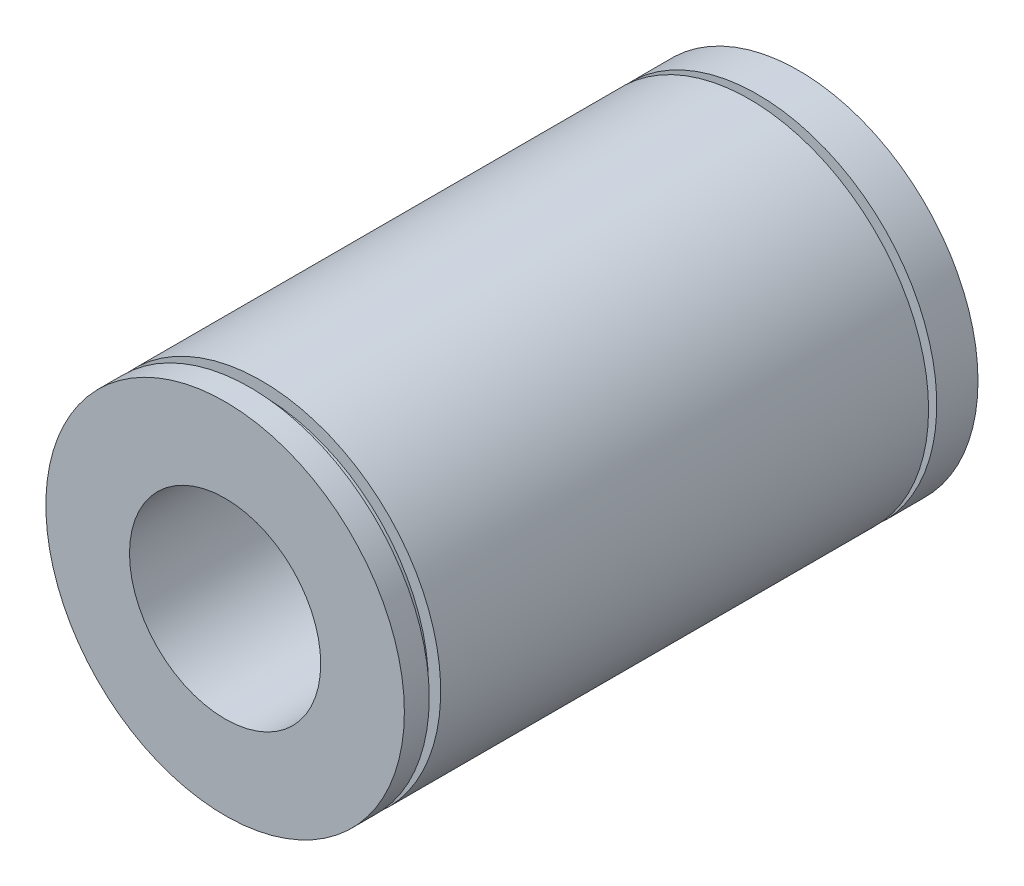
ISO-10303-21;
HEADER;
FILE_DESCRIPTION(('STEP AP214'),'2;1');
FILE_NAME('part.step','',(''),(''),'','','');
FILE_SCHEMA(('AUTOMOTIVE_DESIGN { 1 0 10303 214 1 1 1 1 }'));
ENDSEC;
DATA;
#1=APPLICATION_CONTEXT('core data for automotive mechanical design processes');
#2=APPLICATION_PROTOCOL_DEFINITION('international standard','automotive_design',2000,#1);
#3=PRODUCT_CONTEXT('',#1,'mechanical');
#4=PRODUCT('Part','Part','',(#3));
#5=PRODUCT_RELATED_PRODUCT_CATEGORY('part','',(#4));
#6=PRODUCT_DEFINITION_FORMATION('','',#4);
#7=PRODUCT_DEFINITION_CONTEXT('part definition',#1,'design');
#8=PRODUCT_DEFINITION('design','',#6,#7);
#9=PRODUCT_DEFINITION_SHAPE('','',#8);
#10=(LENGTH_UNIT() NAMED_UNIT(*) SI_UNIT(.MILLI.,.METRE.));
#11=(NAMED_UNIT(*) PLANE_ANGLE_UNIT() SI_UNIT($,.RADIAN.));
#12=(NAMED_UNIT(*) SI_UNIT($,.STERADIAN.) SOLID_ANGLE_UNIT());
#13=UNCERTAINTY_MEASURE_WITH_UNIT(LENGTH_MEASURE(1.E-05),#10,'distance_accuracy_value','');
#14=(GEOMETRIC_REPRESENTATION_CONTEXT(3) GLOBAL_UNCERTAINTY_ASSIGNED_CONTEXT((#13)) GLOBAL_UNIT_ASSIGNED_CONTEXT((#10,
#11,#12)) REPRESENTATION_CONTEXT('',''));
#15=CARTESIAN_POINT('',(0.,0.,0.));
#16=DIRECTION('',(0.,0.,1.));
#17=DIRECTION('',(1.,0.,0.));
#18=AXIS2_PLACEMENT_3D('',#15,#16,#17);
#19=CARTESIAN_POINT('',(0.,0.,24.));
#20=DIRECTION('',(0.,0.,-1.));
#21=DIRECTION('',(-1.,0.,0.));
#22=AXIS2_PLACEMENT_3D('',#19,#20,#21);
#23=CYLINDRICAL_SURFACE('',#22,7.5);
#24=CARTESIAN_POINT('',(0.,0.,22.479934449774));
#25=DIRECTION('',(0.,0.,-1.));
#26=DIRECTION('',(-1.,0.,0.));
#27=AXIS2_PLACEMENT_3D('',#24,#25,#26);
#28=CIRCLE('',#27,7.5);
#29=CARTESIAN_POINT('',(-7.5,0.,22.479934449774));
#30=VERTEX_POINT('',#29);
#31=EDGE_CURVE('E38',#30,#30,#28,.T.);
#32=ORIENTED_EDGE('',*,*,#31,.T.);
#33=EDGE_LOOP('',(#32));
#34=FACE_BOUND('',#33,.T.);
#35=CARTESIAN_POINT('',(0.,0.,2.06803597897237));
#36=DIRECTION('',(0.,0.,1.));
#37=DIRECTION('',(1.,0.,0.));
#38=AXIS2_PLACEMENT_3D('',#35,#36,#37);
#39=CIRCLE('',#38,7.5);
#40=CARTESIAN_POINT('',(7.5,0.,2.06803597897237));
#41=VERTEX_POINT('',#40);
#42=EDGE_CURVE('E53',#41,#41,#39,.T.);
#43=ORIENTED_EDGE('',*,*,#42,.T.);
#44=EDGE_LOOP('',(#43));
#45=FACE_BOUND('',#44,.T.);
#46=ADVANCED_FACE('F34',(#34,#45),#23,.T.);
#47=CARTESIAN_POINT('',(0.,0.,1.7255544610059));
#48=DIRECTION('',(0.,0.,-1.));
#49=DIRECTION('',(-1.,0.,0.));
#50=AXIS2_PLACEMENT_3D('',#47,#48,#49);
#51=CIRCLE('',#50,7.5);
#52=CARTESIAN_POINT('',(-7.5,0.,1.7255544610059));
#53=VERTEX_POINT('',#52);
#54=EDGE_CURVE('E56',#53,#53,#51,.T.);
#55=ORIENTED_EDGE('',*,*,#54,.T.);
#56=EDGE_LOOP('',(#55));
#57=FACE_BOUND('',#56,.T.);
#58=CARTESIAN_POINT('',(0.,0.,0.));
#59=DIRECTION('',(0.,0.,1.));
#60=DIRECTION('',(1.,0.,0.));
#61=AXIS2_PLACEMENT_3D('',#58,#59,#60);
#62=CIRCLE('',#61,7.5);
#63=CARTESIAN_POINT('',(7.5,0.,0.));
#64=VERTEX_POINT('',#63);
#65=EDGE_CURVE('E42',#64,#64,#62,.T.);
#66=ORIENTED_EDGE('',*,*,#65,.T.);
#67=EDGE_LOOP('',(#66));
#68=FACE_BOUND('',#67,.T.);
#69=ADVANCED_FACE('F96',(#57,#68),#23,.T.);
#70=CARTESIAN_POINT('',(0.,0.,24.));
#71=DIRECTION('',(0.,0.,1.));
#72=DIRECTION('',(1.,0.,0.));
#73=AXIS2_PLACEMENT_3D('',#70,#71,#72);
#74=PLANE('',#73);
#75=CARTESIAN_POINT('',(0.,0.,24.));
#76=DIRECTION('',(0.,0.,1.));
#77=DIRECTION('',(1.,0.,0.));
#78=AXIS2_PLACEMENT_3D('',#75,#76,#77);
#79=CIRCLE('',#78,7.5);
#80=CARTESIAN_POINT('',(7.5,0.,24.));
#81=VERTEX_POINT('',#80);
#82=EDGE_CURVE('E10',#81,#81,#79,.T.);
#83=ORIENTED_EDGE('',*,*,#82,.T.);
#84=EDGE_LOOP('',(#83));
#85=FACE_BOUND('',#84,.T.);
#86=CARTESIAN_POINT('',(0.,0.,24.));
#87=DIRECTION('',(0.,0.,1.));
#88=DIRECTION('',(1.,0.,0.));
#89=AXIS2_PLACEMENT_3D('',#86,#87,#88);
#90=CIRCLE('',#89,4.);
#91=CARTESIAN_POINT('',(4.,0.,24.));
#92=VERTEX_POINT('',#91);
#93=EDGE_CURVE('E47',#92,#92,#90,.T.);
#94=ORIENTED_EDGE('',*,*,#93,.F.);
#95=EDGE_LOOP('',(#94));
#96=FACE_BOUND('',#95,.T.);
#97=ADVANCED_FACE('F103',(#85,#96),#74,.T.);
#98=CARTESIAN_POINT('',(0.,0.,0.));
#99=DIRECTION('',(0.,0.,1.));
#100=DIRECTION('',(1.,0.,0.));
#101=AXIS2_PLACEMENT_3D('',#98,#99,#100);
#102=PLANE('',#101);
#103=ORIENTED_EDGE('',*,*,#65,.F.);
#104=EDGE_LOOP('',(#103));
#105=FACE_BOUND('',#104,.T.);
#106=CARTESIAN_POINT('',(0.,0.,0.));
#107=DIRECTION('',(0.,0.,1.));
#108=DIRECTION('',(1.,0.,0.));
#109=AXIS2_PLACEMENT_3D('',#106,#107,#108);
#110=CIRCLE('',#109,4.);
#111=CARTESIAN_POINT('',(4.,0.,0.));
#112=VERTEX_POINT('',#111);
#113=EDGE_CURVE('E50',#112,#112,#110,.T.);
#114=ORIENTED_EDGE('',*,*,#113,.T.);
#115=EDGE_LOOP('',(#114));
#116=FACE_BOUND('',#115,.T.);
#117=ADVANCED_FACE('F83',(#105,#116),#102,.F.);
#118=CARTESIAN_POINT('',(0.,0.,22.959408574927));
#119=DIRECTION('',(0.,0.,1.));
#120=DIRECTION('',(1.,0.,0.));
#121=AXIS2_PLACEMENT_3D('',#118,#119,#120);
#122=CIRCLE('',#121,7.5);
#123=CARTESIAN_POINT('',(7.5,0.,22.959408574927));
#124=VERTEX_POINT('',#123);
#125=EDGE_CURVE('E59',#124,#124,#122,.T.);
#126=ORIENTED_EDGE('',*,*,#125,.T.);
#127=EDGE_LOOP('',(#126));
#128=FACE_BOUND('',#127,.T.);
#129=ORIENTED_EDGE('',*,*,#82,.F.);
#130=EDGE_LOOP('',(#129));
#131=FACE_BOUND('',#130,.T.);
#132=ADVANCED_FACE('F36',(#128,#131),#23,.T.);
#133=CARTESIAN_POINT('',(0.,0.,24.));
#134=DIRECTION('',(0.,0.,-1.));
#135=DIRECTION('',(-1.,0.,0.));
#136=AXIS2_PLACEMENT_3D('',#133,#134,#135);
#137=CYLINDRICAL_SURFACE('',#136,4.);
#138=ORIENTED_EDGE('',*,*,#93,.T.);
#139=EDGE_LOOP('',(#138));
#140=FACE_BOUND('',#139,.T.);
#141=ORIENTED_EDGE('',*,*,#113,.F.);
#142=EDGE_LOOP('',(#141));
#143=FACE_BOUND('',#142,.T.);
#144=ADVANCED_FACE('F85',(#140,#143),#137,.F.);
#145=CARTESIAN_POINT('',(6.9859324795846,0.,1.7255544610059));
#146=DIRECTION('',(0.,0.,-1.));
#147=DIRECTION('',(-1.,0.,0.));
#148=AXIS2_PLACEMENT_3D('',#145,#146,#147);
#149=PLANE('',#148);
#150=CARTESIAN_POINT('',(0.,0.,1.7255544610059));
#151=DIRECTION('',(0.,0.,1.));
#152=DIRECTION('',(1.,0.,0.));
#153=AXIS2_PLACEMENT_3D('',#150,#151,#152);
#154=CIRCLE('',#153,6.9859324795846);
#155=CARTESIAN_POINT('',(6.9859324795846,0.,1.7255544610059));
#156=VERTEX_POINT('',#155);
#157=EDGE_CURVE('E57',#156,#156,#154,.T.);
#158=ORIENTED_EDGE('',*,*,#157,.F.);
#159=EDGE_LOOP('',(#158));
#160=FACE_BOUND('',#159,.T.);
#161=ORIENTED_EDGE('',*,*,#54,.F.);
#162=EDGE_LOOP('',(#161));
#163=FACE_BOUND('',#162,.T.);
#164=ADVANCED_FACE('F87',(#160,#163),#149,.F.);
#165=CARTESIAN_POINT('',(6.9859324795846,0.,2.06803597897237));
#166=DIRECTION('',(0.,0.,1.));
#167=DIRECTION('',(1.,0.,0.));
#168=AXIS2_PLACEMENT_3D('',#165,#166,#167);
#169=PLANE('',#168);
#170=CARTESIAN_POINT('',(0.,0.,2.06803597897237));
#171=DIRECTION('',(0.,0.,1.));
#172=DIRECTION('',(1.,0.,0.));
#173=AXIS2_PLACEMENT_3D('',#170,#171,#172);
#174=CIRCLE('',#173,6.9859324795846);
#175=CARTESIAN_POINT('',(6.9859324795846,0.,2.06803597897237));
#176=VERTEX_POINT('',#175);
#177=EDGE_CURVE('E65',#176,#176,#174,.T.);
#178=ORIENTED_EDGE('',*,*,#177,.T.);
#179=EDGE_LOOP('',(#178));
#180=FACE_BOUND('',#179,.T.);
#181=ORIENTED_EDGE('',*,*,#42,.F.);
#182=EDGE_LOOP('',(#181));
#183=FACE_BOUND('',#182,.T.);
#184=ADVANCED_FACE('F93',(#180,#183),#169,.F.);
#185=CARTESIAN_POINT('',(0.,0.,0.));
#186=DIRECTION('',(0.,0.,1.));
#187=DIRECTION('',(1.,0.,0.));
#188=AXIS2_PLACEMENT_3D('',#185,#186,#187);
#189=CYLINDRICAL_SURFACE('',#188,6.9859324795846);
#190=ORIENTED_EDGE('',*,*,#177,.F.);
#191=EDGE_LOOP('',(#190));
#192=FACE_BOUND('',#191,.T.);
#193=ORIENTED_EDGE('',*,*,#157,.T.);
#194=EDGE_LOOP('',(#193));
#195=FACE_BOUND('',#194,.T.);
#196=ADVANCED_FACE('F110',(#192,#195),#189,.T.);
#197=CARTESIAN_POINT('',(6.9859324795846,0.,22.479934449774));
#198=DIRECTION('',(0.,0.,-1.));
#199=DIRECTION('',(-1.,0.,0.));
#200=AXIS2_PLACEMENT_3D('',#197,#198,#199);
#201=PLANE('',#200);
#202=CARTESIAN_POINT('',(0.,0.,22.479934449774));
#203=DIRECTION('',(0.,0.,1.));
#204=DIRECTION('',(1.,0.,0.));
#205=AXIS2_PLACEMENT_3D('',#202,#203,#204);
#206=CIRCLE('',#205,6.9859324795846);
#207=CARTESIAN_POINT('',(6.9859324795846,0.,22.479934449774));
#208=VERTEX_POINT('',#207);
#209=EDGE_CURVE('E61',#208,#208,#206,.T.);
#210=ORIENTED_EDGE('',*,*,#209,.F.);
#211=EDGE_LOOP('',(#210));
#212=FACE_BOUND('',#211,.T.);
#213=ORIENTED_EDGE('',*,*,#31,.F.);
#214=EDGE_LOOP('',(#213));
#215=FACE_BOUND('',#214,.T.);
#216=ADVANCED_FACE('F116',(#212,#215),#201,.F.);
#217=CARTESIAN_POINT('',(6.9859324795846,0.,22.959408574927));
#218=DIRECTION('',(0.,0.,1.));
#219=DIRECTION('',(1.,0.,0.));
#220=AXIS2_PLACEMENT_3D('',#217,#218,#219);
#221=PLANE('',#220);
#222=CARTESIAN_POINT('',(0.,0.,22.959408574927));
#223=DIRECTION('',(0.,0.,1.));
#224=DIRECTION('',(1.,0.,0.));
#225=AXIS2_PLACEMENT_3D('',#222,#223,#224);
#226=CIRCLE('',#225,6.9859324795846);
#227=CARTESIAN_POINT('',(6.9859324795846,0.,22.959408574927));
#228=VERTEX_POINT('',#227);
#229=EDGE_CURVE('E67',#228,#228,#226,.T.);
#230=ORIENTED_EDGE('',*,*,#229,.T.);
#231=EDGE_LOOP('',(#230));
#232=FACE_BOUND('',#231,.T.);
#233=ORIENTED_EDGE('',*,*,#125,.F.);
#234=EDGE_LOOP('',(#233));
#235=FACE_BOUND('',#234,.T.);
#236=ADVANCED_FACE('F122',(#232,#235),#221,.F.);
#237=CARTESIAN_POINT('',(0.,0.,0.));
#238=DIRECTION('',(0.,0.,1.));
#239=DIRECTION('',(1.,0.,0.));
#240=AXIS2_PLACEMENT_3D('',#237,#238,#239);
#241=CYLINDRICAL_SURFACE('',#240,6.9859324795846);
#242=ORIENTED_EDGE('',*,*,#229,.F.);
#243=EDGE_LOOP('',(#242));
#244=FACE_BOUND('',#243,.T.);
#245=ORIENTED_EDGE('',*,*,#209,.T.);
#246=EDGE_LOOP('',(#245));
#247=FACE_BOUND('',#246,.T.);
#248=ADVANCED_FACE('F124',(#244,#247),#241,.T.);
#249=CLOSED_SHELL('',(#46,#69,#97,#117,#132,#144,#164,#184,#196,#216,#236,#248));
#250=MANIFOLD_SOLID_BREP('B2',#249);
#251=ADVANCED_BREP_SHAPE_REPRESENTATION('',(#18,#250),#14);
#252=SHAPE_DEFINITION_REPRESENTATION(#9,#251);
ENDSEC;
END-ISO-10303-21;
